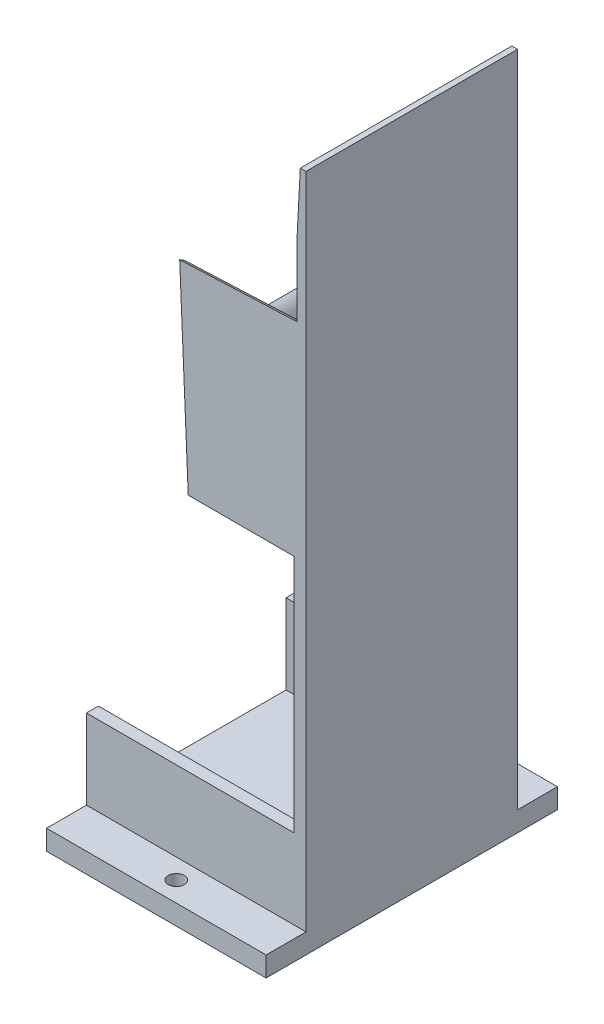
ISO-10303-21;
HEADER;
FILE_DESCRIPTION(('STEP AP214'),'2;1');
FILE_NAME('part.step','',(''),(''),'','','');
FILE_SCHEMA(('AUTOMOTIVE_DESIGN { 1 0 10303 214 1 1 1 1 }'));
ENDSEC;
DATA;
#1=APPLICATION_CONTEXT('core data for automotive mechanical design processes');
#2=APPLICATION_PROTOCOL_DEFINITION('international standard','automotive_design',2000,#1);
#3=PRODUCT_CONTEXT('',#1,'mechanical');
#4=PRODUCT('Part','Part','',(#3));
#5=PRODUCT_RELATED_PRODUCT_CATEGORY('part','',(#4));
#6=PRODUCT_DEFINITION_FORMATION('','',#4);
#7=PRODUCT_DEFINITION_CONTEXT('part definition',#1,'design');
#8=PRODUCT_DEFINITION('design','',#6,#7);
#9=PRODUCT_DEFINITION_SHAPE('','',#8);
#10=(LENGTH_UNIT() NAMED_UNIT(*) SI_UNIT(.MILLI.,.METRE.));
#11=(NAMED_UNIT(*) PLANE_ANGLE_UNIT() SI_UNIT($,.RADIAN.));
#12=(NAMED_UNIT(*) SI_UNIT($,.STERADIAN.) SOLID_ANGLE_UNIT());
#13=UNCERTAINTY_MEASURE_WITH_UNIT(LENGTH_MEASURE(1.E-05),#10,'distance_accuracy_value','');
#14=(GEOMETRIC_REPRESENTATION_CONTEXT(3) GLOBAL_UNCERTAINTY_ASSIGNED_CONTEXT((#13)) GLOBAL_UNIT_ASSIGNED_CONTEXT((#10,
#11,#12)) REPRESENTATION_CONTEXT('',''));
#15=CARTESIAN_POINT('',(0.,0.,0.));
#16=DIRECTION('',(0.,0.,1.));
#17=DIRECTION('',(1.,0.,0.));
#18=AXIS2_PLACEMENT_3D('',#15,#16,#17);
#19=CARTESIAN_POINT('',(24.3867924528302,25.,0.));
#20=DIRECTION('',(-1.,0.,0.));
#21=DIRECTION('',(0.,0.,1.));
#22=AXIS2_PLACEMENT_3D('',#19,#20,#21);
#23=PLANE('',#22);
#24=DIRECTION('',(0.,0.,1.));
#25=VECTOR('',#24,1.);
#26=CARTESIAN_POINT('',(24.3867924528302,25.,0.));
#27=LINE('',#26,#25);
#28=CARTESIAN_POINT('',(24.3867924528302,25.,-23.5));
#29=VERTEX_POINT('',#28);
#30=CARTESIAN_POINT('',(24.3867924528302,25.,23.5));
#31=VERTEX_POINT('',#30);
#32=EDGE_CURVE('E399',#29,#31,#27,.T.);
#33=ORIENTED_EDGE('',*,*,#32,.F.);
#34=DIRECTION('',(0.,-1.,0.));
#35=VECTOR('',#34,1.);
#36=CARTESIAN_POINT('',(24.3867924528302,25.,-23.5));
#37=LINE('',#36,#35);
#38=CARTESIAN_POINT('',(24.3867924528302,5.,-23.5));
#39=VERTEX_POINT('',#38);
#40=EDGE_CURVE('E264',#29,#39,#37,.T.);
#41=ORIENTED_EDGE('',*,*,#40,.T.);
#42=DIRECTION('',(0.,0.,-1.));
#43=VECTOR('',#42,1.);
#44=CARTESIAN_POINT('',(24.3867924528302,5.,0.));
#45=LINE('',#44,#43);
#46=CARTESIAN_POINT('',(24.3867924528302,5.,23.5));
#47=VERTEX_POINT('',#46);
#48=EDGE_CURVE('E409',#47,#39,#45,.T.);
#49=ORIENTED_EDGE('',*,*,#48,.F.);
#50=DIRECTION('',(0.,-1.,0.));
#51=VECTOR('',#50,1.);
#52=CARTESIAN_POINT('',(24.3867924528302,25.,23.5));
#53=LINE('',#52,#51);
#54=EDGE_CURVE('E281',#31,#47,#53,.T.);
#55=ORIENTED_EDGE('',*,*,#54,.F.);
#56=EDGE_LOOP('',(#33,#41,#49,#55));
#57=FACE_BOUND('',#56,.T.);
#58=ADVANCED_FACE('F36',(#57),#23,.T.);
#59=CARTESIAN_POINT('',(0.,25.,23.5));
#60=DIRECTION('',(0.,0.,-1.));
#61=DIRECTION('',(-1.,0.,0.));
#62=AXIS2_PLACEMENT_3D('',#59,#60,#61);
#63=PLANE('',#62);
#64=ORIENTED_EDGE('',*,*,#54,.T.);
#65=DIRECTION('',(1.,0.,0.));
#66=VECTOR('',#65,1.);
#67=CARTESIAN_POINT('',(0.,5.,23.5));
#68=LINE('',#67,#66);
#69=CARTESIAN_POINT('',(-27.5,5.00000000000001,23.5));
#70=VERTEX_POINT('',#69);
#71=EDGE_CURVE('E407',#70,#47,#68,.T.);
#72=ORIENTED_EDGE('',*,*,#71,.F.);
#73=DIRECTION('',(0.,1.,0.));
#74=VECTOR('',#73,1.);
#75=CARTESIAN_POINT('',(-27.5,25.,23.5));
#76=LINE('',#75,#74);
#77=CARTESIAN_POINT('',(-27.5,25.,23.5));
#78=VERTEX_POINT('',#77);
#79=EDGE_CURVE('E440',#70,#78,#76,.T.);
#80=ORIENTED_EDGE('',*,*,#79,.T.);
#81=DIRECTION('',(1.,0.,0.));
#82=VECTOR('',#81,1.);
#83=CARTESIAN_POINT('',(0.,25.,23.5));
#84=LINE('',#83,#82);
#85=EDGE_CURVE('E251',#78,#31,#84,.T.);
#86=ORIENTED_EDGE('',*,*,#85,.T.);
#87=EDGE_LOOP('',(#64,#72,#80,#86));
#88=FACE_BOUND('',#87,.T.);
#89=ADVANCED_FACE('F342',(#88),#63,.T.);
#90=CARTESIAN_POINT('',(0.,25.,-23.5));
#91=DIRECTION('',(0.,0.,-1.));
#92=DIRECTION('',(-1.,0.,0.));
#93=AXIS2_PLACEMENT_3D('',#90,#91,#92);
#94=PLANE('',#93);
#95=ORIENTED_EDGE('',*,*,#40,.F.);
#96=DIRECTION('',(1.,0.,0.));
#97=VECTOR('',#96,1.);
#98=CARTESIAN_POINT('',(0.,25.,-23.5));
#99=LINE('',#98,#97);
#100=CARTESIAN_POINT('',(-27.5,25.,-23.5));
#101=VERTEX_POINT('',#100);
#102=EDGE_CURVE('E253',#101,#29,#99,.T.);
#103=ORIENTED_EDGE('',*,*,#102,.F.);
#104=DIRECTION('',(0.,-1.,0.));
#105=VECTOR('',#104,1.);
#106=CARTESIAN_POINT('',(-27.5,5.,-23.5));
#107=LINE('',#106,#105);
#108=CARTESIAN_POINT('',(-27.5,5.,-23.5));
#109=VERTEX_POINT('',#108);
#110=EDGE_CURVE('E428',#101,#109,#107,.T.);
#111=ORIENTED_EDGE('',*,*,#110,.T.);
#112=DIRECTION('',(1.,0.,0.));
#113=VECTOR('',#112,1.);
#114=CARTESIAN_POINT('',(0.,5.,-23.5));
#115=LINE('',#114,#113);
#116=EDGE_CURVE('E405',#109,#39,#115,.T.);
#117=ORIENTED_EDGE('',*,*,#116,.T.);
#118=EDGE_LOOP('',(#95,#103,#111,#117));
#119=FACE_BOUND('',#118,.T.);
#120=ADVANCED_FACE('F349',(#119),#94,.F.);
#121=CARTESIAN_POINT('',(0.,25.,26.5));
#122=DIRECTION('',(0.,0.,-1.));
#123=DIRECTION('',(-1.,0.,0.));
#124=AXIS2_PLACEMENT_3D('',#121,#122,#123);
#125=PLANE('',#124);
#126=DIRECTION('',(0.0523359562429512,0.998629534754574,0.));
#127=VECTOR('',#126,1.);
#128=CARTESIAN_POINT('',(26.0722333784915,170.,26.5));
#129=LINE('',#128,#127);
#130=CARTESIAN_POINT('',(26.0722333784915,170.,26.5));
#131=VERTEX_POINT('',#130);
#132=CARTESIAN_POINT('',(25.2861166892457,155.,26.5));
#133=VERTEX_POINT('',#132);
#134=EDGE_CURVE('E292',#131,#133,#129,.F.);
#135=ORIENTED_EDGE('',*,*,#134,.T.);
#136=DIRECTION('',(0.,1.,0.));
#137=VECTOR('',#136,1.);
#138=CARTESIAN_POINT('',(25.2861166892457,155.,26.5));
#139=LINE('',#138,#137);
#140=CARTESIAN_POINT('',(25.2861166892457,136.27961750885,26.5));
#141=VERTEX_POINT('',#140);
#142=EDGE_CURVE('E233',#141,#133,#139,.T.);
#143=ORIENTED_EDGE('',*,*,#142,.F.);
#144=DIRECTION('',(0.99908289581767,0.0428178383921865,0.));
#145=VECTOR('',#144,1.);
#146=CARTESIAN_POINT('',(25.2861166892457,136.27961750885,26.5));
#147=LINE('',#146,#145);
#148=CARTESIAN_POINT('',(-4.14364323215628,135.018342083647,26.5));
#149=VERTEX_POINT('',#148);
#150=EDGE_CURVE('E218',#149,#141,#147,.T.);
#151=ORIENTED_EDGE('',*,*,#150,.F.);
#152=DIRECTION('',(-0.0428178383921858,0.99908289581767,0.));
#153=VECTOR('',#152,1.);
#154=CARTESIAN_POINT('',(-5.,155.,26.5));
#155=LINE('',#154,#153);
#156=CARTESIAN_POINT('',(-2.,85.,26.5));
#157=VERTEX_POINT('',#156);
#158=EDGE_CURVE('E231',#157,#149,#155,.T.);
#159=ORIENTED_EDGE('',*,*,#158,.F.);
#160=DIRECTION('',(-1.,0.,0.));
#161=VECTOR('',#160,1.);
#162=CARTESIAN_POINT('',(-2.,85.,26.5));
#163=LINE('',#162,#161);
#164=CARTESIAN_POINT('',(24.5,85.,26.5));
#165=VERTEX_POINT('',#164);
#166=EDGE_CURVE('E240',#165,#157,#163,.T.);
#167=ORIENTED_EDGE('',*,*,#166,.F.);
#168=DIRECTION('',(0.,-1.,0.));
#169=VECTOR('',#168,1.);
#170=CARTESIAN_POINT('',(24.5,25.,26.5));
#171=LINE('',#170,#169);
#172=CARTESIAN_POINT('',(24.5,25.,26.5));
#173=VERTEX_POINT('',#172);
#174=EDGE_CURVE('E402',#165,#173,#171,.T.);
#175=ORIENTED_EDGE('',*,*,#174,.T.);
#176=DIRECTION('',(1.,0.,0.));
#177=VECTOR('',#176,1.);
#178=CARTESIAN_POINT('',(0.,25.,26.5));
#179=LINE('',#178,#177);
#180=CARTESIAN_POINT('',(-27.5,25.,26.5));
#181=VERTEX_POINT('',#180);
#182=EDGE_CURVE('E256',#181,#173,#179,.T.);
#183=ORIENTED_EDGE('',*,*,#182,.F.);
#184=DIRECTION('',(0.,-1.,0.));
#185=VECTOR('',#184,1.);
#186=CARTESIAN_POINT('',(-27.5,25.,26.5));
#187=LINE('',#186,#185);
#188=CARTESIAN_POINT('',(-27.5,5.,26.5));
#189=VERTEX_POINT('',#188);
#190=EDGE_CURVE('E267',#181,#189,#187,.T.);
#191=ORIENTED_EDGE('',*,*,#190,.T.);
#192=DIRECTION('',(1.,0.,0.));
#193=VECTOR('',#192,1.);
#194=CARTESIAN_POINT('',(0.,5.,26.5));
#195=LINE('',#194,#193);
#196=CARTESIAN_POINT('',(27.5,5.,26.5));
#197=VERTEX_POINT('',#196);
#198=EDGE_CURVE('E456',#189,#197,#195,.T.);
#199=ORIENTED_EDGE('',*,*,#198,.T.);
#200=DIRECTION('',(0.,-1.,0.));
#201=VECTOR('',#200,1.);
#202=CARTESIAN_POINT('',(27.5,25.,26.5));
#203=LINE('',#202,#201);
#204=CARTESIAN_POINT('',(27.5,170.,26.5));
#205=VERTEX_POINT('',#204);
#206=EDGE_CURVE('E276',#205,#197,#203,.T.);
#207=ORIENTED_EDGE('',*,*,#206,.F.);
#208=DIRECTION('',(-1.,0.,0.));
#209=VECTOR('',#208,1.);
#210=CARTESIAN_POINT('',(29.5,170.,26.5));
#211=LINE('',#210,#209);
#212=EDGE_CURVE('E444',#205,#131,#211,.T.);
#213=ORIENTED_EDGE('',*,*,#212,.T.);
#214=EDGE_LOOP('',(#135,#143,#151,#159,#167,#175,#183,#191,#199,#207,#213));
#215=FACE_BOUND('',#214,.T.);
#216=ADVANCED_FACE('F230',(#215),#125,.F.);
#217=CARTESIAN_POINT('',(27.5,25.,0.));
#218=DIRECTION('',(-1.,0.,0.));
#219=DIRECTION('',(0.,0.,1.));
#220=AXIS2_PLACEMENT_3D('',#217,#218,#219);
#221=PLANE('',#220);
#222=DIRECTION('',(0.,-1.,0.));
#223=VECTOR('',#222,1.);
#224=CARTESIAN_POINT('',(27.5,25.,-26.5));
#225=LINE('',#224,#223);
#226=CARTESIAN_POINT('',(27.5,170.,-26.5));
#227=VERTEX_POINT('',#226);
#228=CARTESIAN_POINT('',(27.5,5.,-26.5));
#229=VERTEX_POINT('',#228);
#230=EDGE_CURVE('E274',#227,#229,#225,.T.);
#231=ORIENTED_EDGE('',*,*,#230,.F.);
#232=DIRECTION('',(0.,0.,1.));
#233=VECTOR('',#232,1.);
#234=CARTESIAN_POINT('',(27.5,170.,0.));
#235=LINE('',#234,#233);
#236=EDGE_CURVE('E447',#227,#205,#235,.T.);
#237=ORIENTED_EDGE('',*,*,#236,.T.);
#238=ORIENTED_EDGE('',*,*,#206,.T.);
#239=DIRECTION('',(0.,0.,1.));
#240=VECTOR('',#239,1.);
#241=CARTESIAN_POINT('',(27.5,5.,0.));
#242=LINE('',#241,#240);
#243=CARTESIAN_POINT('',(27.5,5.,36.5));
#244=VERTEX_POINT('',#243);
#245=EDGE_CURVE('E453',#197,#244,#242,.T.);
#246=ORIENTED_EDGE('',*,*,#245,.T.);
#247=DIRECTION('',(0.,-1.,0.));
#248=VECTOR('',#247,1.);
#249=CARTESIAN_POINT('',(27.5,5.,36.5));
#250=LINE('',#249,#248);
#251=CARTESIAN_POINT('',(27.5,0.,36.5));
#252=VERTEX_POINT('',#251);
#253=EDGE_CURVE('E469',#244,#252,#250,.T.);
#254=ORIENTED_EDGE('',*,*,#253,.T.);
#255=DIRECTION('',(0.,0.,-1.));
#256=VECTOR('',#255,1.);
#257=CARTESIAN_POINT('',(27.5,0.,0.));
#258=LINE('',#257,#256);
#259=CARTESIAN_POINT('',(27.5,0.,-36.5));
#260=VERTEX_POINT('',#259);
#261=EDGE_CURVE('E250',#252,#260,#258,.T.);
#262=ORIENTED_EDGE('',*,*,#261,.T.);
#263=DIRECTION('',(0.,-1.,0.));
#264=VECTOR('',#263,1.);
#265=CARTESIAN_POINT('',(27.5,5.,-36.5));
#266=LINE('',#265,#264);
#267=CARTESIAN_POINT('',(27.5,5.,-36.5));
#268=VERTEX_POINT('',#267);
#269=EDGE_CURVE('E495',#268,#260,#266,.T.);
#270=ORIENTED_EDGE('',*,*,#269,.F.);
#271=DIRECTION('',(0.,0.,-1.));
#272=VECTOR('',#271,1.);
#273=CARTESIAN_POINT('',(27.5,5.,0.));
#274=LINE('',#273,#272);
#275=EDGE_CURVE('E493',#229,#268,#274,.T.);
#276=ORIENTED_EDGE('',*,*,#275,.F.);
#277=EDGE_LOOP('',(#231,#237,#238,#246,#254,#262,#270,#276));
#278=FACE_BOUND('',#277,.T.);
#279=ADVANCED_FACE('F364',(#278),#221,.F.);
#280=CARTESIAN_POINT('',(0.,25.,-26.5));
#281=DIRECTION('',(0.,0.,-1.));
#282=DIRECTION('',(-1.,0.,0.));
#283=AXIS2_PLACEMENT_3D('',#280,#281,#282);
#284=PLANE('',#283);
#285=DIRECTION('',(0.,-1.,0.));
#286=VECTOR('',#285,1.);
#287=CARTESIAN_POINT('',(25.2861166892457,25.,-26.5));
#288=LINE('',#287,#286);
#289=CARTESIAN_POINT('',(25.2861166892457,155.,-26.5));
#290=VERTEX_POINT('',#289);
#291=CARTESIAN_POINT('',(25.2861166892457,136.27961750885,-26.5));
#292=VERTEX_POINT('',#291);
#293=EDGE_CURVE('E581',#290,#292,#288,.T.);
#294=ORIENTED_EDGE('',*,*,#293,.F.);
#295=DIRECTION('',(-0.0523359562429512,-0.998629534754574,0.));
#296=VECTOR('',#295,1.);
#297=CARTESIAN_POINT('',(18.4225065803704,24.0345173412954,-26.5));
#298=LINE('',#297,#296);
#299=CARTESIAN_POINT('',(26.0722333784915,170.,-26.5));
#300=VERTEX_POINT('',#299);
#301=EDGE_CURVE('E294',#290,#300,#298,.F.);
#302=ORIENTED_EDGE('',*,*,#301,.T.);
#303=DIRECTION('',(-1.,0.,0.));
#304=VECTOR('',#303,1.);
#305=CARTESIAN_POINT('',(29.5,170.,-26.5));
#306=LINE('',#305,#304);
#307=EDGE_CURVE('E443',#227,#300,#306,.T.);
#308=ORIENTED_EDGE('',*,*,#307,.F.);
#309=ORIENTED_EDGE('',*,*,#230,.T.);
#310=DIRECTION('',(1.,0.,0.));
#311=VECTOR('',#310,1.);
#312=CARTESIAN_POINT('',(0.,5.,-26.5));
#313=LINE('',#312,#311);
#314=CARTESIAN_POINT('',(-27.5,5.,-26.5));
#315=VERTEX_POINT('',#314);
#316=EDGE_CURVE('E490',#315,#229,#313,.T.);
#317=ORIENTED_EDGE('',*,*,#316,.F.);
#318=DIRECTION('',(0.,-1.,0.));
#319=VECTOR('',#318,1.);
#320=CARTESIAN_POINT('',(-27.5,25.,-26.5));
#321=LINE('',#320,#319);
#322=CARTESIAN_POINT('',(-27.5,25.,-26.5));
#323=VERTEX_POINT('',#322);
#324=EDGE_CURVE('E270',#323,#315,#321,.T.);
#325=ORIENTED_EDGE('',*,*,#324,.F.);
#326=DIRECTION('',(1.,0.,0.));
#327=VECTOR('',#326,1.);
#328=CARTESIAN_POINT('',(0.,25.,-26.5));
#329=LINE('',#328,#327);
#330=CARTESIAN_POINT('',(24.5,25.,-26.5));
#331=VERTEX_POINT('',#330);
#332=EDGE_CURVE('E258',#323,#331,#329,.T.);
#333=ORIENTED_EDGE('',*,*,#332,.T.);
#334=DIRECTION('',(0.,-1.,0.));
#335=VECTOR('',#334,1.);
#336=CARTESIAN_POINT('',(24.5,25.,-26.5));
#337=LINE('',#336,#335);
#338=CARTESIAN_POINT('',(24.5,85.,-26.5));
#339=VERTEX_POINT('',#338);
#340=EDGE_CURVE('E505',#339,#331,#337,.T.);
#341=ORIENTED_EDGE('',*,*,#340,.F.);
#342=DIRECTION('',(1.,0.,0.));
#343=VECTOR('',#342,1.);
#344=CARTESIAN_POINT('',(0.,85.,-26.5));
#345=LINE('',#344,#343);
#346=CARTESIAN_POINT('',(-2.,85.,-26.5));
#347=VERTEX_POINT('',#346);
#348=EDGE_CURVE('E413',#347,#339,#345,.T.);
#349=ORIENTED_EDGE('',*,*,#348,.F.);
#350=DIRECTION('',(0.0428178383921858,-0.99908289581767,0.));
#351=VECTOR('',#350,1.);
#352=CARTESIAN_POINT('',(1.63984518231819,0.0702790792422083,-26.5));
#353=LINE('',#352,#351);
#354=CARTESIAN_POINT('',(-4.14364323215628,135.018342083647,-26.5));
#355=VERTEX_POINT('',#354);
#356=EDGE_CURVE('E415',#355,#347,#353,.T.);
#357=ORIENTED_EDGE('',*,*,#356,.F.);
#358=DIRECTION('',(-0.99908289581767,-0.0428178383921865,0.));
#359=VECTOR('',#358,1.);
#360=CARTESIAN_POINT('',(-4.71402416513659,134.993897186519,-26.5));
#361=LINE('',#360,#359);
#362=EDGE_CURVE('E377',#292,#355,#361,.T.);
#363=ORIENTED_EDGE('',*,*,#362,.F.);
#364=EDGE_LOOP('',(#294,#302,#308,#309,#317,#325,#333,#341,#349,#357,#363));
#365=FACE_BOUND('',#364,.T.);
#366=ADVANCED_FACE('F356',(#365),#284,.T.);
#367=CARTESIAN_POINT('',(24.3867924528302,131.654292789432,28.5));
#368=DIRECTION('',(-1.,0.,0.));
#369=DIRECTION('',(0.,1.,0.));
#370=AXIS2_PLACEMENT_3D('',#367,#368,#369);
#371=ELLIPSE('',#370,5.00458973017239,5.);
#372=CARTESIAN_POINT('',(24.3867924528302,131.654292789432,23.5));
#373=VERTEX_POINT('',#372);
#374=CARTESIAN_POINT('',(24.3867924528302,133.418768284939,23.821075531345));
#375=VERTEX_POINT('',#374);
#376=EDGE_CURVE('E304',#373,#375,#371,.F.);
#377=ORIENTED_EDGE('',*,*,#376,.T.);
#378=DIRECTION('',(0.,0.,-1.));
#379=VECTOR('',#378,1.);
#380=CARTESIAN_POINT('',(24.3867924528302,133.418768284939,-23.5));
#381=LINE('',#380,#379);
#382=CARTESIAN_POINT('',(24.3867924528302,133.418768284939,-23.821075531345));
#383=VERTEX_POINT('',#382);
#384=EDGE_CURVE('E300',#375,#383,#381,.T.);
#385=ORIENTED_EDGE('',*,*,#384,.T.);
#386=CARTESIAN_POINT('',(24.3867924528302,131.654292789432,-28.5));
#387=DIRECTION('',(-1.,0.,0.));
#388=DIRECTION('',(0.,1.,0.));
#389=AXIS2_PLACEMENT_3D('',#386,#387,#388);
#390=ELLIPSE('',#389,5.00458973017239,5.);
#391=CARTESIAN_POINT('',(24.3867924528302,131.654292789432,-23.5));
#392=VERTEX_POINT('',#391);
#393=EDGE_CURVE('E307',#383,#392,#390,.F.);
#394=ORIENTED_EDGE('',*,*,#393,.T.);
#395=CARTESIAN_POINT('',(24.3867924528302,85.,-23.5));
#396=VERTEX_POINT('',#395);
#397=EDGE_CURVE('E279',#392,#396,#37,.T.);
#398=ORIENTED_EDGE('',*,*,#397,.T.);
#399=DIRECTION('',(0.,0.,-1.));
#400=VECTOR('',#399,1.);
#401=CARTESIAN_POINT('',(24.3867924528302,85.,0.));
#402=LINE('',#401,#400);
#403=CARTESIAN_POINT('',(24.3867924528302,85.,23.5));
#404=VERTEX_POINT('',#403);
#405=EDGE_CURVE('E387',#404,#396,#402,.T.);
#406=ORIENTED_EDGE('',*,*,#405,.F.);
#407=EDGE_CURVE('E271',#373,#404,#53,.T.);
#408=ORIENTED_EDGE('',*,*,#407,.F.);
#409=EDGE_LOOP('',(#377,#385,#394,#398,#406,#408));
#410=FACE_BOUND('',#409,.T.);
#411=ADVANCED_FACE('F345',(#410),#23,.T.);
#412=DIRECTION('',(-0.0428178383921859,0.99908289581767,0.));
#413=VECTOR('',#412,1.);
#414=CARTESIAN_POINT('',(-3.28728646431256,115.036684167293,23.5));
#415=LINE('',#414,#413);
#416=CARTESIAN_POINT('',(-3.28728646431256,115.036684167293,23.5));
#417=VERTEX_POINT('',#416);
#418=CARTESIAN_POINT('',(-3.9474272466297,130.439969088026,23.5));
#419=VERTEX_POINT('',#418);
#420=EDGE_CURVE('E425',#417,#419,#415,.T.);
#421=ORIENTED_EDGE('',*,*,#420,.T.);
#422=DIRECTION('',(-0.99908289581767,-0.0428178383921865,0.));
#423=VECTOR('',#422,1.);
#424=CARTESIAN_POINT('',(24.5830084383568,131.662702045954,23.5));
#425=LINE('',#424,#423);
#426=EDGE_CURVE('E219',#419,#373,#425,.F.);
#427=ORIENTED_EDGE('',*,*,#426,.T.);
#428=ORIENTED_EDGE('',*,*,#407,.T.);
#429=DIRECTION('',(1.,0.,0.));
#430=VECTOR('',#429,1.);
#431=CARTESIAN_POINT('',(0.,85.,23.5));
#432=LINE('',#431,#430);
#433=CARTESIAN_POINT('',(0.,85.,23.5));
#434=VERTEX_POINT('',#433);
#435=EDGE_CURVE('E390',#434,#404,#432,.T.);
#436=ORIENTED_EDGE('',*,*,#435,.F.);
#437=DIRECTION('',(0.,1.,0.));
#438=VECTOR('',#437,1.);
#439=CARTESIAN_POINT('',(0.,0.,23.5));
#440=LINE('',#439,#438);
#441=CARTESIAN_POINT('',(0.,97.7274934341639,23.5));
#442=VERTEX_POINT('',#441);
#443=EDGE_CURVE('E412',#434,#442,#440,.T.);
#444=ORIENTED_EDGE('',*,*,#443,.T.);
#445=DIRECTION('',(0.034899496702498,-0.999390827019096,0.));
#446=VECTOR('',#445,1.);
#447=CARTESIAN_POINT('',(0.,97.7274934341639,23.5));
#448=LINE('',#447,#446);
#449=CARTESIAN_POINT('',(-0.453119909941049,110.703149942769,23.5));
#450=VERTEX_POINT('',#449);
#451=EDGE_CURVE('E285',#442,#450,#448,.F.);
#452=ORIENTED_EDGE('',*,*,#451,.T.);
#453=CARTESIAN_POINT('',(-5.45007404503653,110.528652459256,23.5));
#454=DIRECTION('',(0.,0.,-1.));
#455=DIRECTION('',(-1.,0.,0.));
#456=AXIS2_PLACEMENT_3D('',#453,#454,#455);
#457=CIRCLE('',#456,5.);
#458=EDGE_CURVE('E11',#450,#417,#457,.F.);
#459=ORIENTED_EDGE('',*,*,#458,.T.);
#460=EDGE_LOOP('',(#421,#427,#428,#436,#444,#452,#459));
#461=FACE_BOUND('',#460,.T.);
#462=ADVANCED_FACE('F352',(#461),#63,.T.);
#463=ORIENTED_EDGE('',*,*,#397,.F.);
#464=DIRECTION('',(0.99908289581767,0.0428178383921865,0.));
#465=VECTOR('',#464,1.);
#466=CARTESIAN_POINT('',(-4.51780817961001,130.415524190899,-23.5));
#467=LINE('',#466,#465);
#468=CARTESIAN_POINT('',(-3.9474272466297,130.439969088026,-23.5));
#469=VERTEX_POINT('',#468);
#470=EDGE_CURVE('E302',#392,#469,#467,.F.);
#471=ORIENTED_EDGE('',*,*,#470,.T.);
#472=DIRECTION('',(0.0428178383921859,-0.99908289581767,0.));
#473=VECTOR('',#472,1.);
#474=CARTESIAN_POINT('',(-3.28728646431256,115.036684167293,-23.5));
#475=LINE('',#474,#473);
#476=CARTESIAN_POINT('',(-3.28728646431256,115.036684167293,-23.5));
#477=VERTEX_POINT('',#476);
#478=EDGE_CURVE('E434',#469,#477,#475,.T.);
#479=ORIENTED_EDGE('',*,*,#478,.T.);
#480=CARTESIAN_POINT('',(-5.45007404503653,110.528652459256,-23.5));
#481=DIRECTION('',(0.,0.,-1.));
#482=DIRECTION('',(-1.,0.,0.));
#483=AXIS2_PLACEMENT_3D('',#480,#481,#482);
#484=CIRCLE('',#483,5.);
#485=CARTESIAN_POINT('',(-0.453119909941049,110.703149942769,-23.5));
#486=VERTEX_POINT('',#485);
#487=EDGE_CURVE('E44',#477,#486,#484,.T.);
#488=ORIENTED_EDGE('',*,*,#487,.T.);
#489=DIRECTION('',(-0.034899496702498,0.999390827019096,0.));
#490=VECTOR('',#489,1.);
#491=CARTESIAN_POINT('',(2.53660674310793,25.0885802593673,-23.5));
#492=LINE('',#491,#490);
#493=CARTESIAN_POINT('',(0.,97.7274934341639,-23.5));
#494=VERTEX_POINT('',#493);
#495=EDGE_CURVE('E287',#486,#494,#492,.F.);
#496=ORIENTED_EDGE('',*,*,#495,.T.);
#497=DIRECTION('',(0.,-1.,0.));
#498=VECTOR('',#497,1.);
#499=CARTESIAN_POINT('',(0.,185.,-23.5));
#500=LINE('',#499,#498);
#501=CARTESIAN_POINT('',(0.,85.,-23.5));
#502=VERTEX_POINT('',#501);
#503=EDGE_CURVE('E242',#494,#502,#500,.T.);
#504=ORIENTED_EDGE('',*,*,#503,.T.);
#505=DIRECTION('',(1.,0.,0.));
#506=VECTOR('',#505,1.);
#507=CARTESIAN_POINT('',(0.,85.,-23.5));
#508=LINE('',#507,#506);
#509=EDGE_CURVE('E382',#502,#396,#508,.T.);
#510=ORIENTED_EDGE('',*,*,#509,.T.);
#511=EDGE_LOOP('',(#463,#471,#479,#488,#496,#504,#510));
#512=FACE_BOUND('',#511,.T.);
#513=ADVANCED_FACE('F362',(#512),#94,.F.);
#514=CARTESIAN_POINT('',(-27.5,25.,0.));
#515=DIRECTION('',(-1.,0.,0.));
#516=DIRECTION('',(0.,0.,1.));
#517=AXIS2_PLACEMENT_3D('',#514,#515,#516);
#518=PLANE('',#517);
#519=ORIENTED_EDGE('',*,*,#110,.F.);
#520=DIRECTION('',(0.,0.,-1.));
#521=VECTOR('',#520,1.);
#522=CARTESIAN_POINT('',(-27.5,25.,0.));
#523=LINE('',#522,#521);
#524=EDGE_CURVE('E260',#101,#323,#523,.T.);
#525=ORIENTED_EDGE('',*,*,#524,.T.);
#526=ORIENTED_EDGE('',*,*,#324,.T.);
#527=DIRECTION('',(0.,0.,1.));
#528=VECTOR('',#527,1.);
#529=CARTESIAN_POINT('',(-27.5,5.,0.));
#530=LINE('',#529,#528);
#531=CARTESIAN_POINT('',(-27.5,5.,-36.5));
#532=VERTEX_POINT('',#531);
#533=EDGE_CURVE('E487',#532,#315,#530,.T.);
#534=ORIENTED_EDGE('',*,*,#533,.F.);
#535=DIRECTION('',(0.,-1.,0.));
#536=VECTOR('',#535,1.);
#537=CARTESIAN_POINT('',(-27.5,5.,-36.5));
#538=LINE('',#537,#536);
#539=CARTESIAN_POINT('',(-27.5,0.,-36.5));
#540=VERTEX_POINT('',#539);
#541=EDGE_CURVE('E502',#532,#540,#538,.T.);
#542=ORIENTED_EDGE('',*,*,#541,.T.);
#543=DIRECTION('',(0.,0.,-1.));
#544=VECTOR('',#543,1.);
#545=CARTESIAN_POINT('',(-27.5,0.,0.));
#546=LINE('',#545,#544);
#547=CARTESIAN_POINT('',(-27.5,0.,36.5));
#548=VERTEX_POINT('',#547);
#549=EDGE_CURVE('E254',#548,#540,#546,.T.);
#550=ORIENTED_EDGE('',*,*,#549,.F.);
#551=DIRECTION('',(0.,-1.,0.));
#552=VECTOR('',#551,1.);
#553=CARTESIAN_POINT('',(-27.5,5.,36.5));
#554=LINE('',#553,#552);
#555=CARTESIAN_POINT('',(-27.5,5.,36.5));
#556=VERTEX_POINT('',#555);
#557=EDGE_CURVE('E476',#556,#548,#554,.T.);
#558=ORIENTED_EDGE('',*,*,#557,.F.);
#559=DIRECTION('',(0.,0.,-1.));
#560=VECTOR('',#559,1.);
#561=CARTESIAN_POINT('',(-27.5,5.,0.));
#562=LINE('',#561,#560);
#563=EDGE_CURVE('E460',#556,#189,#562,.T.);
#564=ORIENTED_EDGE('',*,*,#563,.T.);
#565=ORIENTED_EDGE('',*,*,#190,.F.);
#566=EDGE_CURVE('E261',#181,#78,#523,.T.);
#567=ORIENTED_EDGE('',*,*,#566,.T.);
#568=ORIENTED_EDGE('',*,*,#79,.F.);
#569=DIRECTION('',(0.,0.,1.));
#570=VECTOR('',#569,1.);
#571=CARTESIAN_POINT('',(-27.5,5.00000000000001,23.5));
#572=LINE('',#571,#570);
#573=EDGE_CURVE('E432',#109,#70,#572,.T.);
#574=ORIENTED_EDGE('',*,*,#573,.F.);
#575=EDGE_LOOP('',(#519,#525,#526,#534,#542,#550,#558,#564,#565,#567,#568,#574));
#576=FACE_BOUND('',#575,.T.);
#577=ADVANCED_FACE('F537',(#576),#518,.T.);
#578=CARTESIAN_POINT('',(0.,25.,0.));
#579=DIRECTION('',(0.,1.,0.));
#580=DIRECTION('',(0.,0.,1.));
#581=AXIS2_PLACEMENT_3D('',#578,#579,#580);
#582=PLANE('',#581);
#583=ORIENTED_EDGE('',*,*,#524,.F.);
#584=ORIENTED_EDGE('',*,*,#102,.T.);
#585=ORIENTED_EDGE('',*,*,#32,.T.);
#586=ORIENTED_EDGE('',*,*,#85,.F.);
#587=ORIENTED_EDGE('',*,*,#566,.F.);
#588=ORIENTED_EDGE('',*,*,#182,.T.);
#589=DIRECTION('',(0.,0.,-1.));
#590=VECTOR('',#589,1.);
#591=CARTESIAN_POINT('',(24.5,25.,33.5));
#592=LINE('',#591,#590);
#593=EDGE_CURVE('E388',#173,#331,#592,.T.);
#594=ORIENTED_EDGE('',*,*,#593,.T.);
#595=ORIENTED_EDGE('',*,*,#332,.F.);
#596=EDGE_LOOP('',(#583,#584,#585,#586,#587,#588,#594,#595));
#597=FACE_BOUND('',#596,.T.);
#598=ADVANCED_FACE('F521',(#597),#582,.T.);
#599=CARTESIAN_POINT('',(0.,0.,0.));
#600=DIRECTION('',(0.,1.,0.));
#601=DIRECTION('',(0.,0.,1.));
#602=AXIS2_PLACEMENT_3D('',#599,#600,#601);
#603=PLANE('',#602);
#604=ORIENTED_EDGE('',*,*,#261,.F.);
#605=DIRECTION('',(-1.,0.,0.));
#606=VECTOR('',#605,1.);
#607=CARTESIAN_POINT('',(0.,0.,36.5));
#608=LINE('',#607,#606);
#609=EDGE_CURVE('E452',#252,#548,#608,.T.);
#610=ORIENTED_EDGE('',*,*,#609,.T.);
#611=ORIENTED_EDGE('',*,*,#549,.T.);
#612=DIRECTION('',(-1.,0.,0.));
#613=VECTOR('',#612,1.);
#614=CARTESIAN_POINT('',(0.,0.,-36.5));
#615=LINE('',#614,#613);
#616=EDGE_CURVE('E484',#260,#540,#615,.T.);
#617=ORIENTED_EDGE('',*,*,#616,.F.);
#618=EDGE_LOOP('',(#604,#610,#611,#617));
#619=FACE_BOUND('',#618,.T.);
#620=CARTESIAN_POINT('',(0.,0.,-31.5));
#621=DIRECTION('',(0.,1.,0.));
#622=DIRECTION('',(0.,0.,1.));
#623=AXIS2_PLACEMENT_3D('',#620,#621,#622);
#624=CIRCLE('',#623,2.);
#625=CARTESIAN_POINT('',(0.,0.,-29.5));
#626=VERTEX_POINT('',#625);
#627=EDGE_CURVE('E479',#626,#626,#624,.T.);
#628=ORIENTED_EDGE('',*,*,#627,.T.);
#629=EDGE_LOOP('',(#628));
#630=FACE_BOUND('',#629,.T.);
#631=CARTESIAN_POINT('',(0.,0.,31.5));
#632=DIRECTION('',(0.,1.,0.));
#633=DIRECTION('',(0.,0.,1.));
#634=AXIS2_PLACEMENT_3D('',#631,#632,#633);
#635=CIRCLE('',#634,2.);
#636=CARTESIAN_POINT('',(0.,0.,33.5));
#637=VERTEX_POINT('',#636);
#638=EDGE_CURVE('E457',#637,#637,#635,.F.);
#639=ORIENTED_EDGE('',*,*,#638,.F.);
#640=EDGE_LOOP('',(#639));
#641=FACE_BOUND('',#640,.T.);
#642=ADVANCED_FACE('F532',(#619,#630,#641),#603,.F.);
#643=CARTESIAN_POINT('',(-5.,155.,26.5));
#644=DIRECTION('',(-0.99908289581767,-0.0428178383921858,0.));
#645=DIRECTION('',(0.0428178383921858,-0.99908289581767,0.));
#646=AXIS2_PLACEMENT_3D('',#643,#644,#645);
#647=PLANE('',#646);
#648=ORIENTED_EDGE('',*,*,#158,.T.);
#649=CARTESIAN_POINT('',(-3.9474272466297,130.439969088026,28.5));
#650=DIRECTION('',(-0.99908289581767,-0.0428178383921858,0.));
#651=DIRECTION('',(0.0428178383921858,-0.99908289581767,0.));
#652=AXIS2_PLACEMENT_3D('',#649,#650,#651);
#653=CIRCLE('',#652,5.);
#654=EDGE_CURVE('E213',#149,#419,#653,.T.);
#655=ORIENTED_EDGE('',*,*,#654,.T.);
#656=ORIENTED_EDGE('',*,*,#420,.F.);
#657=DIRECTION('',(0.,0.,1.));
#658=VECTOR('',#657,1.);
#659=CARTESIAN_POINT('',(-3.28728646431256,115.036684167293,-23.5));
#660=LINE('',#659,#658);
#661=EDGE_CURVE('E429',#477,#417,#660,.T.);
#662=ORIENTED_EDGE('',*,*,#661,.F.);
#663=ORIENTED_EDGE('',*,*,#478,.F.);
#664=CARTESIAN_POINT('',(-3.9474272466297,130.439969088026,-28.5));
#665=DIRECTION('',(-0.99908289581767,-0.0428178383921858,0.));
#666=DIRECTION('',(0.0428178383921858,-0.99908289581767,0.));
#667=AXIS2_PLACEMENT_3D('',#664,#665,#666);
#668=CIRCLE('',#667,5.);
#669=EDGE_CURVE('E224',#469,#355,#668,.T.);
#670=ORIENTED_EDGE('',*,*,#669,.T.);
#671=ORIENTED_EDGE('',*,*,#356,.T.);
#672=DIRECTION('',(0.,0.,-1.));
#673=VECTOR('',#672,1.);
#674=CARTESIAN_POINT('',(-2.,85.,26.5));
#675=LINE('',#674,#673);
#676=EDGE_CURVE('E239',#157,#347,#675,.T.);
#677=ORIENTED_EDGE('',*,*,#676,.F.);
#678=EDGE_LOOP('',(#648,#655,#656,#662,#663,#670,#671,#677));
#679=FACE_BOUND('',#678,.T.);
#680=ADVANCED_FACE('F237',(#679),#647,.T.);
#681=CARTESIAN_POINT('',(-2.,85.,26.5));
#682=DIRECTION('',(0.,-1.,0.));
#683=DIRECTION('',(0.,0.,-1.));
#684=AXIS2_PLACEMENT_3D('',#681,#682,#683);
#685=PLANE('',#684);
#686=ORIENTED_EDGE('',*,*,#509,.F.);
#687=DIRECTION('',(0.,0.,1.));
#688=VECTOR('',#687,1.);
#689=CARTESIAN_POINT('',(0.,85.,-26.5));
#690=LINE('',#689,#688);
#691=EDGE_CURVE('E244',#502,#434,#690,.T.);
#692=ORIENTED_EDGE('',*,*,#691,.T.);
#693=ORIENTED_EDGE('',*,*,#435,.T.);
#694=ORIENTED_EDGE('',*,*,#405,.T.);
#695=EDGE_LOOP('',(#686,#692,#693,#694));
#696=FACE_BOUND('',#695,.T.);
#697=ORIENTED_EDGE('',*,*,#676,.T.);
#698=ORIENTED_EDGE('',*,*,#348,.T.);
#699=DIRECTION('',(0.,0.,-1.));
#700=VECTOR('',#699,1.);
#701=CARTESIAN_POINT('',(24.5,85.,33.5));
#702=LINE('',#701,#700);
#703=EDGE_CURVE('E393',#165,#339,#702,.T.);
#704=ORIENTED_EDGE('',*,*,#703,.F.);
#705=ORIENTED_EDGE('',*,*,#166,.T.);
#706=EDGE_LOOP('',(#697,#698,#704,#705));
#707=FACE_BOUND('',#706,.T.);
#708=ADVANCED_FACE('F419',(#696,#707),#685,.T.);
#709=CARTESIAN_POINT('',(0.,0.,-26.5));
#710=DIRECTION('',(1.,0.,0.));
#711=DIRECTION('',(0.,0.,-1.));
#712=AXIS2_PLACEMENT_3D('',#709,#710,#711);
#713=PLANE('',#712);
#714=ORIENTED_EDGE('',*,*,#503,.F.);
#715=DIRECTION('',(0.,0.,1.));
#716=VECTOR('',#715,1.);
#717=CARTESIAN_POINT('',(0.,97.7274934341639,-26.5));
#718=LINE('',#717,#716);
#719=EDGE_CURVE('E278',#494,#442,#718,.T.);
#720=ORIENTED_EDGE('',*,*,#719,.T.);
#721=ORIENTED_EDGE('',*,*,#443,.F.);
#722=ORIENTED_EDGE('',*,*,#691,.F.);
#723=EDGE_LOOP('',(#714,#720,#721,#722));
#724=FACE_BOUND('',#723,.T.);
#725=ADVANCED_FACE('F422',(#724),#713,.T.);
#726=CARTESIAN_POINT('',(0.,97.7274934341639,-26.5));
#727=DIRECTION('',(-0.999390827019096,-0.034899496702498,0.));
#728=DIRECTION('',(0.,0.,1.));
#729=AXIS2_PLACEMENT_3D('',#726,#727,#728);
#730=PLANE('',#729);
#731=ORIENTED_EDGE('',*,*,#495,.F.);
#732=DIRECTION('',(0.,0.,-1.));
#733=VECTOR('',#732,1.);
#734=CARTESIAN_POINT('',(-0.453119909941049,110.703149942769,23.5));
#735=LINE('',#734,#733);
#736=EDGE_CURVE('E57',#486,#450,#735,.F.);
#737=ORIENTED_EDGE('',*,*,#736,.T.);
#738=ORIENTED_EDGE('',*,*,#451,.F.);
#739=ORIENTED_EDGE('',*,*,#719,.F.);
#740=EDGE_LOOP('',(#731,#737,#738,#739));
#741=FACE_BOUND('',#740,.T.);
#742=ADVANCED_FACE('F530',(#741),#730,.F.);
#743=CARTESIAN_POINT('',(0.,5.,0.));
#744=DIRECTION('',(0.,1.,0.));
#745=DIRECTION('',(0.,0.,1.));
#746=AXIS2_PLACEMENT_3D('',#743,#744,#745);
#747=PLANE('',#746);
#748=ORIENTED_EDGE('',*,*,#48,.T.);
#749=ORIENTED_EDGE('',*,*,#116,.F.);
#750=ORIENTED_EDGE('',*,*,#573,.T.);
#751=ORIENTED_EDGE('',*,*,#71,.T.);
#752=EDGE_LOOP('',(#748,#749,#750,#751));
#753=FACE_BOUND('',#752,.T.);
#754=ADVANCED_FACE('F562',(#753),#747,.T.);
#755=CARTESIAN_POINT('',(24.5,25.,33.5));
#756=DIRECTION('',(1.,0.,0.));
#757=DIRECTION('',(0.,0.,-1.));
#758=AXIS2_PLACEMENT_3D('',#755,#756,#757);
#759=PLANE('',#758);
#760=ORIENTED_EDGE('',*,*,#703,.T.);
#761=ORIENTED_EDGE('',*,*,#340,.T.);
#762=ORIENTED_EDGE('',*,*,#593,.F.);
#763=ORIENTED_EDGE('',*,*,#174,.F.);
#764=EDGE_LOOP('',(#760,#761,#762,#763));
#765=FACE_BOUND('',#764,.T.);
#766=ADVANCED_FACE('F513',(#765),#759,.F.);
#767=CARTESIAN_POINT('',(0.,5.,-36.5));
#768=DIRECTION('',(0.,0.,1.));
#769=DIRECTION('',(1.,0.,0.));
#770=AXIS2_PLACEMENT_3D('',#767,#768,#769);
#771=PLANE('',#770);
#772=ORIENTED_EDGE('',*,*,#616,.T.);
#773=ORIENTED_EDGE('',*,*,#541,.F.);
#774=DIRECTION('',(-1.,0.,0.));
#775=VECTOR('',#774,1.);
#776=CARTESIAN_POINT('',(0.,5.,-36.5));
#777=LINE('',#776,#775);
#778=EDGE_CURVE('E483',#268,#532,#777,.T.);
#779=ORIENTED_EDGE('',*,*,#778,.F.);
#780=ORIENTED_EDGE('',*,*,#269,.T.);
#781=EDGE_LOOP('',(#772,#773,#779,#780));
#782=FACE_BOUND('',#781,.T.);
#783=ADVANCED_FACE('F746',(#782),#771,.F.);
#784=CARTESIAN_POINT('',(0.,5.,-31.5));
#785=DIRECTION('',(0.,-1.,0.));
#786=DIRECTION('',(0.,0.,-1.));
#787=AXIS2_PLACEMENT_3D('',#784,#785,#786);
#788=CYLINDRICAL_SURFACE('',#787,2.);
#789=CARTESIAN_POINT('',(0.,5.,-31.5));
#790=DIRECTION('',(0.,1.,0.));
#791=DIRECTION('',(0.,0.,1.));
#792=AXIS2_PLACEMENT_3D('',#789,#790,#791);
#793=CIRCLE('',#792,2.);
#794=CARTESIAN_POINT('',(0.,5.,-29.5));
#795=VERTEX_POINT('',#794);
#796=EDGE_CURVE('E480',#795,#795,#793,.T.);
#797=ORIENTED_EDGE('',*,*,#796,.T.);
#798=EDGE_LOOP('',(#797));
#799=FACE_BOUND('',#798,.T.);
#800=ORIENTED_EDGE('',*,*,#627,.F.);
#801=EDGE_LOOP('',(#800));
#802=FACE_BOUND('',#801,.T.);
#803=ADVANCED_FACE('F736',(#799,#802),#788,.F.);
#804=CARTESIAN_POINT('',(0.,5.,0.));
#805=DIRECTION('',(0.,1.,0.));
#806=DIRECTION('',(0.,0.,1.));
#807=AXIS2_PLACEMENT_3D('',#804,#805,#806);
#808=PLANE('',#807);
#809=ORIENTED_EDGE('',*,*,#796,.F.);
#810=EDGE_LOOP('',(#809));
#811=FACE_BOUND('',#810,.T.);
#812=ORIENTED_EDGE('',*,*,#778,.T.);
#813=ORIENTED_EDGE('',*,*,#533,.T.);
#814=ORIENTED_EDGE('',*,*,#316,.T.);
#815=ORIENTED_EDGE('',*,*,#275,.T.);
#816=EDGE_LOOP('',(#812,#813,#814,#815));
#817=FACE_BOUND('',#816,.T.);
#818=ADVANCED_FACE('F726',(#811,#817),#808,.T.);
#819=CARTESIAN_POINT('',(0.,5.,36.5));
#820=DIRECTION('',(0.,0.,1.));
#821=DIRECTION('',(1.,0.,0.));
#822=AXIS2_PLACEMENT_3D('',#819,#820,#821);
#823=PLANE('',#822);
#824=ORIENTED_EDGE('',*,*,#609,.F.);
#825=ORIENTED_EDGE('',*,*,#253,.F.);
#826=DIRECTION('',(-1.,0.,0.));
#827=VECTOR('',#826,1.);
#828=CARTESIAN_POINT('',(0.,5.,36.5));
#829=LINE('',#828,#827);
#830=EDGE_CURVE('E463',#244,#556,#829,.T.);
#831=ORIENTED_EDGE('',*,*,#830,.T.);
#832=ORIENTED_EDGE('',*,*,#557,.T.);
#833=EDGE_LOOP('',(#824,#825,#831,#832));
#834=FACE_BOUND('',#833,.T.);
#835=ADVANCED_FACE('F716',(#834),#823,.T.);
#836=CARTESIAN_POINT('',(0.,5.,31.5));
#837=DIRECTION('',(0.,-1.,0.));
#838=DIRECTION('',(0.,0.,-1.));
#839=AXIS2_PLACEMENT_3D('',#836,#837,#838);
#840=CYLINDRICAL_SURFACE('',#839,2.);
#841=CARTESIAN_POINT('',(0.,5.,31.5));
#842=DIRECTION('',(0.,1.,0.));
#843=DIRECTION('',(0.,0.,1.));
#844=AXIS2_PLACEMENT_3D('',#841,#842,#843);
#845=CIRCLE('',#844,2.);
#846=CARTESIAN_POINT('',(0.,5.,33.5));
#847=VERTEX_POINT('',#846);
#848=EDGE_CURVE('E466',#847,#847,#845,.F.);
#849=ORIENTED_EDGE('',*,*,#848,.F.);
#850=EDGE_LOOP('',(#849));
#851=FACE_BOUND('',#850,.T.);
#852=ORIENTED_EDGE('',*,*,#638,.T.);
#853=EDGE_LOOP('',(#852));
#854=FACE_BOUND('',#853,.T.);
#855=ADVANCED_FACE('F707',(#851,#854),#840,.F.);
#856=CARTESIAN_POINT('',(0.,5.,0.));
#857=DIRECTION('',(0.,1.,0.));
#858=DIRECTION('',(0.,0.,1.));
#859=AXIS2_PLACEMENT_3D('',#856,#857,#858);
#860=PLANE('',#859);
#861=ORIENTED_EDGE('',*,*,#245,.F.);
#862=ORIENTED_EDGE('',*,*,#198,.F.);
#863=ORIENTED_EDGE('',*,*,#563,.F.);
#864=ORIENTED_EDGE('',*,*,#830,.F.);
#865=EDGE_LOOP('',(#861,#862,#863,#864));
#866=FACE_BOUND('',#865,.T.);
#867=ORIENTED_EDGE('',*,*,#848,.T.);
#868=EDGE_LOOP('',(#867));
#869=FACE_BOUND('',#868,.T.);
#870=ADVANCED_FACE('F570',(#866,#869),#860,.T.);
#871=CARTESIAN_POINT('',(29.5,170.,-26.5));
#872=DIRECTION('',(0.,-1.,0.));
#873=DIRECTION('',(1.,0.,0.));
#874=AXIS2_PLACEMENT_3D('',#871,#872,#873);
#875=PLANE('',#874);
#876=ORIENTED_EDGE('',*,*,#307,.T.);
#877=DIRECTION('',(0.,0.,1.));
#878=VECTOR('',#877,1.);
#879=CARTESIAN_POINT('',(26.0722333784915,170.,-26.5));
#880=LINE('',#879,#878);
#881=EDGE_CURVE('E289',#300,#131,#880,.T.);
#882=ORIENTED_EDGE('',*,*,#881,.T.);
#883=ORIENTED_EDGE('',*,*,#212,.F.);
#884=ORIENTED_EDGE('',*,*,#236,.F.);
#885=EDGE_LOOP('',(#876,#882,#883,#884));
#886=FACE_BOUND('',#885,.T.);
#887=ADVANCED_FACE('F578',(#886),#875,.F.);
#888=CARTESIAN_POINT('',(26.0722333784915,170.,-26.5));
#889=DIRECTION('',(0.998629534754573,-0.0523359562429512,0.));
#890=DIRECTION('',(0.,0.,1.));
#891=AXIS2_PLACEMENT_3D('',#888,#889,#890);
#892=PLANE('',#891);
#893=ORIENTED_EDGE('',*,*,#301,.F.);
#894=DIRECTION('',(0.,0.,1.));
#895=VECTOR('',#894,1.);
#896=CARTESIAN_POINT('',(25.2861166892457,155.,-26.5));
#897=LINE('',#896,#895);
#898=EDGE_CURVE('E296',#133,#290,#897,.F.);
#899=ORIENTED_EDGE('',*,*,#898,.F.);
#900=ORIENTED_EDGE('',*,*,#134,.F.);
#901=ORIENTED_EDGE('',*,*,#881,.F.);
#902=EDGE_LOOP('',(#893,#899,#900,#901));
#903=FACE_BOUND('',#902,.T.);
#904=ADVANCED_FACE('F337',(#903),#892,.F.);
#905=CARTESIAN_POINT('',(25.2861166892457,155.,-43.5));
#906=DIRECTION('',(1.,0.,0.));
#907=DIRECTION('',(0.,1.,0.));
#908=AXIS2_PLACEMENT_3D('',#905,#906,#907);
#909=PLANE('',#908);
#910=ORIENTED_EDGE('',*,*,#293,.T.);
#911=DIRECTION('',(0.,0.,1.));
#912=VECTOR('',#911,1.);
#913=CARTESIAN_POINT('',(25.2861166892457,136.27961750885,-43.5));
#914=LINE('',#913,#912);
#915=EDGE_CURVE('E372',#292,#141,#914,.T.);
#916=ORIENTED_EDGE('',*,*,#915,.T.);
#917=ORIENTED_EDGE('',*,*,#142,.T.);
#918=ORIENTED_EDGE('',*,*,#898,.T.);
#919=EDGE_LOOP('',(#910,#916,#917,#918));
#920=FACE_BOUND('',#919,.T.);
#921=ADVANCED_FACE('F330',(#920),#909,.F.);
#922=CARTESIAN_POINT('',(25.4823326747723,131.701244513229,-28.5));
#923=DIRECTION('',(0.99908289581767,0.0428178383921865,0.));
#924=DIRECTION('',(-0.0428178383921865,0.99908289581767,0.));
#925=AXIS2_PLACEMENT_3D('',#922,#923,#924);
#926=CYLINDRICAL_SURFACE('',#925,5.);
#927=ORIENTED_EDGE('',*,*,#470,.F.);
#928=ORIENTED_EDGE('',*,*,#393,.F.);
#929=CARTESIAN_POINT('',(24.3867924528302,133.418768284939,-23.821075531345));
#930=CARTESIAN_POINT('',(24.3867698895077,133.539722114565,-23.8665758666904));
#931=CARTESIAN_POINT('',(24.3911796761546,133.658844581461,-23.9167179671801));
#932=CARTESIAN_POINT('',(24.4079029230391,133.892347337196,-24.0255479966612));
#933=CARTESIAN_POINT('',(24.4202049817934,134.006734213898,-24.0842235035554));
#934=CARTESIAN_POINT('',(24.4516272287588,134.229120665246,-24.2090016545523));
#935=CARTESIAN_POINT('',(24.4706904271716,134.337165087434,-24.2750391472417));
#936=CARTESIAN_POINT('',(24.5146315433802,134.547298135045,-24.4142739421417));
#937=CARTESIAN_POINT('',(24.5395114139317,134.649384745914,-24.4874736440182));
#938=CARTESIAN_POINT('',(24.6210161908963,134.944842439318,-24.7159937058112));
#939=CARTESIAN_POINT('',(24.6847348074295,135.128852533854,-24.8810530973088));
#940=CARTESIAN_POINT('',(24.8231210354448,135.469836162738,-25.2335402919462));
#941=CARTESIAN_POINT('',(24.897814513745,135.626743864205,-25.4210207398392));
#942=CARTESIAN_POINT('',(25.0268028819154,135.868918469425,-25.7562826116219));
#943=CARTESIAN_POINT('',(25.0804747459629,135.961537252448,-25.8990403414537));
#944=CARTESIAN_POINT('',(25.1594236014126,136.089320663317,-26.1197146038096));
#945=CARTESIAN_POINT('',(25.1854315185729,136.129990073523,-26.1942127465477));
#946=CARTESIAN_POINT('',(25.2365523927106,136.207615662745,-26.3454443485604));
#947=CARTESIAN_POINT('',(25.2616651054046,136.244570833147,-26.4221784077466));
#948=CARTESIAN_POINT('',(25.2861166892457,136.27961750885,-26.5));
#949=B_SPLINE_CURVE_WITH_KNOTS('',3,(#929,#930,#931,#932,#933,#934,#935,#936,#937,#938,#939,
#940,#941,#942,#943,#944,#945,#946,#947,#948),.UNSPECIFIED.,.F.,.F.,(4,2,2,2,2,2,2,2,2,4),(0.,
0.387398752283823,0.774239109653079,1.15789338291556,1.54167664086084,2.30428582749828,
3.06872214143457,3.60319708719117,3.86941225102558,4.1356995121261),.UNSPECIFIED.);
#950=EDGE_CURVE('E235',#292,#383,#949,.F.);
#951=ORIENTED_EDGE('',*,*,#950,.F.);
#952=ORIENTED_EDGE('',*,*,#362,.T.);
#953=ORIENTED_EDGE('',*,*,#669,.F.);
#954=EDGE_LOOP('',(#927,#928,#951,#952,#953));
#955=FACE_BOUND('',#954,.T.);
#956=ADVANCED_FACE('F327',(#955),#926,.T.);
#957=CARTESIAN_POINT('',(29.3867924528302,133.418768284939,-43.5));
#958=DIRECTION('',(0.,0.,1.));
#959=DIRECTION('',(1.,0.,0.));
#960=AXIS2_PLACEMENT_3D('',#957,#958,#959);
#961=CYLINDRICAL_SURFACE('',#960,5.);
#962=ORIENTED_EDGE('',*,*,#384,.F.);
#963=CARTESIAN_POINT('',(24.6049481397215,134.879577980002,32.3310206149167));
#964=CARTESIAN_POINT('',(24.6396493697318,134.993195611614,32.2370500174405));
#965=CARTESIAN_POINT('',(24.6773787572227,135.102186518712,32.1387256305441));
#966=CARTESIAN_POINT('',(24.7571492973989,135.310544754262,31.9340792689663));
#967=CARTESIAN_POINT('',(24.7991878257427,135.409917869255,31.827762172379));
#968=CARTESIAN_POINT('',(24.8863482413071,135.599832705636,31.6065321785811));
#969=CARTESIAN_POINT('',(24.9314986171921,135.690266993456,31.4915385817945));
#970=CARTESIAN_POINT('',(25.0226433322695,135.860806035385,31.2544108604144));
#971=CARTESIAN_POINT('',(25.0686378262234,135.94090887326,31.1322754172682));
#972=CARTESIAN_POINT('',(25.1594946120882,136.090397245681,30.8812339912026));
#973=CARTESIAN_POINT('',(25.2043570994437,136.159784641024,30.7523291890417));
#974=CARTESIAN_POINT('',(25.2908076834025,136.287365131257,30.4879976836126));
#975=CARTESIAN_POINT('',(25.3323955023331,136.345557277458,30.3525704288443));
#976=CARTESIAN_POINT('',(25.4097033602991,136.449766803533,30.0763432662225));
#977=CARTESIAN_POINT('',(25.4454535364813,136.495847514065,29.935575896427));
#978=CARTESIAN_POINT('',(25.5088355824202,136.575356787954,29.6487522314272));
#979=CARTESIAN_POINT('',(25.5364726294945,136.608793423952,29.5026993762493));
#980=CARTESIAN_POINT('',(25.5743121814247,136.653820463983,29.2527469802578));
#981=CARTESIAN_POINT('',(25.5872638833862,136.668971641665,29.1498935608776));
#982=CARTESIAN_POINT('',(25.6076206129478,136.692620424445,28.942888698531));
#983=CARTESIAN_POINT('',(25.6150270601717,136.701119732494,28.8387375947271));
#984=CARTESIAN_POINT('',(25.62391552861,136.711305821701,28.6299104447977));
#985=CARTESIAN_POINT('',(25.6254010851676,136.712996668175,28.525234749304));
#986=CARTESIAN_POINT('',(25.6223811085882,136.709545106896,28.3160796692155));
#987=CARTESIAN_POINT('',(25.6178752690165,136.704402349634,28.2116002949352));
#988=CARTESIAN_POINT('',(25.603125355036,136.68740539834,28.0039156192424));
#989=CARTESIAN_POINT('',(25.5928984258566,136.67557125623,27.9007074483153));
#990=CARTESIAN_POINT('',(25.5672213114988,136.645417182577,27.6958958992045));
#991=CARTESIAN_POINT('',(25.5517693191679,136.627095006965,27.594293088998));
#992=CARTESIAN_POINT('',(25.4985227925216,136.562728470567,27.2924364231032));
#993=CARTESIAN_POINT('',(25.4538516057251,136.507298588742,27.095303819871));
#994=CARTESIAN_POINT('',(25.3674265699245,136.393358830651,26.7682899379027));
#995=CARTESIAN_POINT('',(25.3286194290372,136.340458765497,26.6355583810742));
#996=CARTESIAN_POINT('',(25.2472566412549,136.223994064687,26.3760488247548));
#997=CARTESIAN_POINT('',(25.204701264087,136.160430196114,26.2492703978751));
#998=CARTESIAN_POINT('',(25.117767739905,136.023005741145,26.0017178489092));
#999=CARTESIAN_POINT('',(25.0733858594074,135.949123241912,25.8809572670213));
#1000=CARTESIAN_POINT('',(24.9847315408748,135.79153745087,25.6460061667213));
#1001=CARTESIAN_POINT('',(24.9404590890667,135.707835466763,25.5318147764746));
#1002=CARTESIAN_POINT('',(24.8529387189162,135.529274138087,25.3083446065294));
#1003=CARTESIAN_POINT('',(24.8097238026435,135.434240409533,25.1991919966288));
#1004=CARTESIAN_POINT('',(24.7268840922018,135.234517336838,24.9885688029004));
#1005=CARTESIAN_POINT('',(24.6872599142717,135.129826341525,24.88709953817));
#1006=CARTESIAN_POINT('',(24.613423797062,134.911480368086,24.6928810072238));
#1007=CARTESIAN_POINT('',(24.5791950972691,134.797854861353,24.6001051152996));
#1008=CARTESIAN_POINT('',(24.5177025774016,134.561927581348,24.4238467559353));
#1009=CARTESIAN_POINT('',(24.4904345074869,134.439631160706,24.340358635464));
#1010=CARTESIAN_POINT('',(24.4419447251531,134.172975641312,24.1748774019677));
#1011=CARTESIAN_POINT('',(24.4217357698923,134.027676795416,24.0940882389526));
#1012=CARTESIAN_POINT('',(24.3941609124324,133.72879679333,23.9466338073762));
#1013=CARTESIAN_POINT('',(24.3867962283578,133.575214853013,23.8799698789499));
#1014=CARTESIAN_POINT('',(24.3867900902201,133.320868791183,23.784221243734));
#1015=CARTESIAN_POINT('',(24.3896701673247,133.22184754503,23.7504094267886));
#1016=CARTESIAN_POINT('',(24.4015416998978,133.022200592347,23.6890841002389));
#1017=CARTESIAN_POINT('',(24.4105338312717,132.92157470957,23.6615712876639));
#1018=CARTESIAN_POINT('',(24.434880178758,132.719541086945,23.6130185581021));
#1019=CARTESIAN_POINT('',(24.4502339646274,132.618133400427,23.5919782035461));
#1020=CARTESIAN_POINT('',(24.4874315203871,132.415327463961,23.5564013829059));
#1021=CARTESIAN_POINT('',(24.509277583716,132.313929230037,23.5418672197304));
#1022=CARTESIAN_POINT('',(24.5594249725482,132.112122611606,23.5192387651462));
#1023=CARTESIAN_POINT('',(24.5877199986301,132.011713360244,23.5111382237035));
#1024=CARTESIAN_POINT('',(24.6506565751028,131.812552217799,23.5011356950143));
#1025=CARTESIAN_POINT('',(24.6853006314257,131.713800997992,23.4992361608649));
#1026=CARTESIAN_POINT('',(24.7606931094856,131.518733066462,23.501312720348));
#1027=CARTESIAN_POINT('',(24.8014409756346,131.422416134094,23.5052882795028));
#1028=CARTESIAN_POINT('',(24.8887323983827,131.232820235862,23.5186833997874));
#1029=CARTESIAN_POINT('',(24.93527826196,131.139542498013,23.528105133371));
#1030=CARTESIAN_POINT('',(25.0833212749492,130.864669750786,23.5638764256345));
#1031=CARTESIAN_POINT('',(25.1930853742658,130.68839152281,23.5977250283578));
#1032=CARTESIAN_POINT('',(25.4313614815408,130.35332335734,23.6808826456163));
#1033=CARTESIAN_POINT('',(25.559874565996,130.194534424936,23.7301925480687));
#1034=CARTESIAN_POINT('',(25.8570518675381,129.869462476485,23.8492885781909));
#1035=CARTESIAN_POINT('',(26.028802822887,129.706769970712,23.9211505044024));
#1036=CARTESIAN_POINT('',(26.3917006292424,129.408179169461,24.0725864356642));
#1037=CARTESIAN_POINT('',(26.5828878909527,129.272338502147,24.1521764924719));
#1038=CARTESIAN_POINT('',(26.903843458813,129.076520211754,24.2799136172044));
#1039=CARTESIAN_POINT('',(27.028260808866,129.007694941401,24.3281392061458));
#1040=CARTESIAN_POINT('',(27.2831051006012,128.880618106422,24.4226076351575));
#1041=CARTESIAN_POINT('',(27.4135336801962,128.822369445276,24.4688499281226));
#1042=CARTESIAN_POINT('',(27.8127934658508,128.6643834752,24.6012577033283));
#1043=CARTESIAN_POINT('',(28.0905193305845,128.580841021913,24.6814997974781));
#1044=CARTESIAN_POINT('',(28.5813484718765,128.479681992588,24.7887336682035));
#1045=CARTESIAN_POINT('',(28.7900312751063,128.450008840546,24.8244056470939));
#1046=CARTESIAN_POINT('',(29.1065092487054,128.42550478036,24.85999244995));
#1047=CARTESIAN_POINT('',(29.2125879554456,128.420671538353,24.8688678480863));
#1048=CARTESIAN_POINT('',(29.4251631604862,128.417787614418,24.8802452174956));
#1049=CARTESIAN_POINT('',(29.531659505365,128.4197346393,24.8827493431338));
#1050=CARTESIAN_POINT('',(29.7441696371895,128.430422357979,24.8812442975639));
#1051=CARTESIAN_POINT('',(29.8501837550937,128.439157326838,24.8772406119265));
#1052=CARTESIAN_POINT('',(30.0610517110315,128.463302433848,24.8629430228908));
#1053=CARTESIAN_POINT('',(30.165905147164,128.478714814295,24.8526470060305));
#1054=CARTESIAN_POINT('',(30.3742672240429,128.516100128451,24.8261932773372));
#1055=CARTESIAN_POINT('',(30.4777653695502,128.538108492106,24.8100038057169));
#1056=CARTESIAN_POINT('',(30.6822201976928,128.58834719847,24.7725453399689));
#1057=CARTESIAN_POINT('',(30.783178837079,128.616572576318,24.7512803979479));
#1058=CARTESIAN_POINT('',(30.8826470642773,128.647770592484,24.7278506971578));
#1059=B_SPLINE_CURVE_WITH_KNOTS('',3,(#963,#964,#965,#966,#967,#968,#969,#970,#971,#972,#973,
#974,#975,#976,#977,#978,#979,#980,#981,#982,#983,#984,#985,#986,#987,#988,#989,#990,#991,#992,
#993,#994,#995,#996,#997,#998,#999,#1000,#1001,#1002,#1003,#1004,#1005,#1006,#1007,#1008,#1009,
#1010,#1011,#1012,#1013,#1014,#1015,#1016,#1017,#1018,#1019,#1020,#1021,#1022,#1023,#1024,#1025,
#1026,#1027,#1028,#1029,#1030,#1031,#1032,#1033,#1034,#1035,#1036,#1037,#1038,#1039,#1040,#1041,
#1042,#1043,#1044,#1045,#1046,#1047,#1048,#1049,#1050,#1051,#1052,#1053,#1054,#1055,#1056,#1057,
#1058),.UNSPECIFIED.,.F.,.F.,(4,2,2,2,2,2,2,2,2,2,2,2,2,2,2,2,2,2,2,2,2,2,2,2,2,2,2,2,2,2,2,2,2,
2,2,2,2,2,2,2,2,2,2,2,2,2,2,4),(0.,0.454143682945042,0.908012409526624,1.366802079696,
1.82567672230821,2.28447158897425,2.74330531696738,3.19968979465417,3.6557823985795,
3.969755086657,4.28364736802079,4.5973521972854,4.91107307184543,5.22385877109551,
5.53675276197698,6.16304716266107,6.60674152043444,7.05040397553248,7.49502334671542,
7.93958357316901,8.3921825393374,8.8448590335588,9.2961003769697,9.74706555065196,
10.2482979015103,10.7495777856359,11.0632634579377,11.376983825015,11.6906829784269,
12.0044930800594,12.3179979521965,12.631626830755,12.9452271791536,13.2589527076803,
13.8875377715126,14.5161589405731,15.2552981693009,15.9960068804962,16.4459514734508,
16.8960193985955,17.7927441060775,18.4312489257957,18.7505630725912,19.0697692329916,
19.3887064673253,19.7077508848983,20.0285407186047,20.3490752947898),.UNSPECIFIED.);
#1060=EDGE_CURVE('E309',#141,#375,#1059,.T.);
#1061=ORIENTED_EDGE('',*,*,#1060,.F.);
#1062=ORIENTED_EDGE('',*,*,#915,.F.);
#1063=ORIENTED_EDGE('',*,*,#950,.T.);
#1064=EDGE_LOOP('',(#962,#1061,#1062,#1063));
#1065=FACE_BOUND('',#1064,.T.);
#1066=ADVANCED_FACE('F322',(#1065),#961,.T.);
#1067=CARTESIAN_POINT('',(25.4823326747723,131.701244513229,28.5));
#1068=DIRECTION('',(0.99908289581767,0.0428178383921865,0.));
#1069=DIRECTION('',(-0.0428178383921865,0.99908289581767,0.));
#1070=AXIS2_PLACEMENT_3D('',#1067,#1068,#1069);
#1071=CYLINDRICAL_SURFACE('',#1070,5.);
#1072=ORIENTED_EDGE('',*,*,#376,.F.);
#1073=ORIENTED_EDGE('',*,*,#426,.F.);
#1074=ORIENTED_EDGE('',*,*,#654,.F.);
#1075=ORIENTED_EDGE('',*,*,#150,.T.);
#1076=ORIENTED_EDGE('',*,*,#1060,.T.);
#1077=EDGE_LOOP('',(#1072,#1073,#1074,#1075,#1076));
#1078=FACE_BOUND('',#1077,.T.);
#1079=ADVANCED_FACE('F216',(#1078),#1071,.T.);
#1080=CARTESIAN_POINT('',(-5.45007404503653,110.528652459256,-23.5));
#1081=DIRECTION('',(0.,0.,-1.));
#1082=DIRECTION('',(-1.,0.,0.));
#1083=AXIS2_PLACEMENT_3D('',#1080,#1081,#1082);
#1084=CYLINDRICAL_SURFACE('',#1083,5.);
#1085=ORIENTED_EDGE('',*,*,#458,.F.);
#1086=ORIENTED_EDGE('',*,*,#736,.F.);
#1087=ORIENTED_EDGE('',*,*,#487,.F.);
#1088=ORIENTED_EDGE('',*,*,#661,.T.);
#1089=EDGE_LOOP('',(#1085,#1086,#1087,#1088));
#1090=FACE_BOUND('',#1089,.T.);
#1091=ADVANCED_FACE('F38',(#1090),#1084,.T.);
#1092=CLOSED_SHELL('',(#58,#89,#120,#216,#279,#366,#411,#462,#513,#577,#598,#642,#680,#708,#725,
#742,#754,#766,#783,#803,#818,#835,#855,#870,#887,#904,#921,#956,#1066,#1079,#1091));
#1093=MANIFOLD_SOLID_BREP('B2',#1092);
#1094=ADVANCED_BREP_SHAPE_REPRESENTATION('',(#18,#1093),#14);
#1095=SHAPE_DEFINITION_REPRESENTATION(#9,#1094);
ENDSEC;
END-ISO-10303-21;
